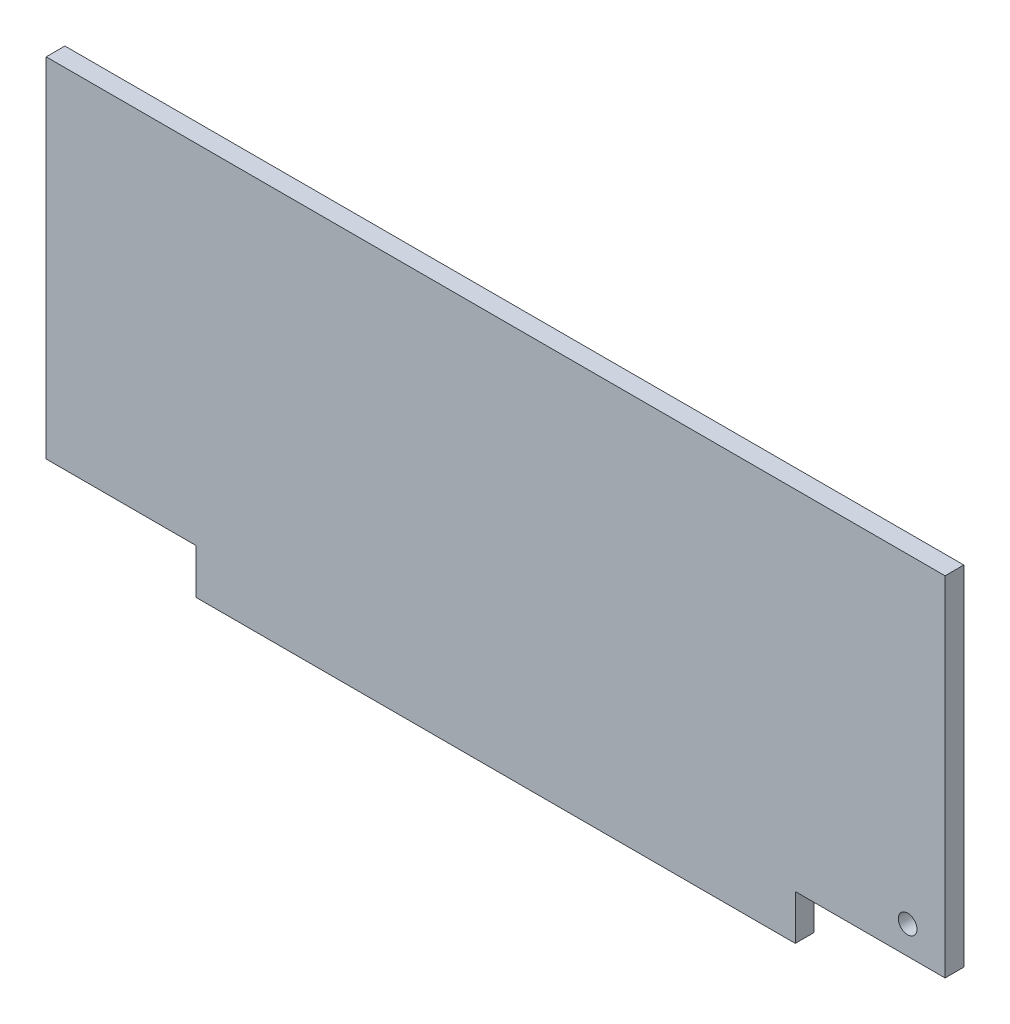
ISO-10303-21;
HEADER;
FILE_DESCRIPTION(('STEP AP214'),'2;1');
FILE_NAME('part.step','',(''),(''),'','','');
FILE_SCHEMA(('AUTOMOTIVE_DESIGN { 1 0 10303 214 1 1 1 1 }'));
ENDSEC;
DATA;
#1=APPLICATION_CONTEXT('core data for automotive mechanical design processes');
#2=APPLICATION_PROTOCOL_DEFINITION('international standard','automotive_design',2000,#1);
#3=PRODUCT_CONTEXT('',#1,'mechanical');
#4=PRODUCT('Part','Part','',(#3));
#5=PRODUCT_RELATED_PRODUCT_CATEGORY('part','',(#4));
#6=PRODUCT_DEFINITION_FORMATION('','',#4);
#7=PRODUCT_DEFINITION_CONTEXT('part definition',#1,'design');
#8=PRODUCT_DEFINITION('design','',#6,#7);
#9=PRODUCT_DEFINITION_SHAPE('','',#8);
#10=(LENGTH_UNIT() NAMED_UNIT(*) SI_UNIT(.MILLI.,.METRE.));
#11=(NAMED_UNIT(*) PLANE_ANGLE_UNIT() SI_UNIT($,.RADIAN.));
#12=(NAMED_UNIT(*) SI_UNIT($,.STERADIAN.) SOLID_ANGLE_UNIT());
#13=UNCERTAINTY_MEASURE_WITH_UNIT(LENGTH_MEASURE(1.E-05),#10,'distance_accuracy_value','');
#14=(GEOMETRIC_REPRESENTATION_CONTEXT(3) GLOBAL_UNCERTAINTY_ASSIGNED_CONTEXT((#13)) GLOBAL_UNIT_ASSIGNED_CONTEXT((#10,
#11,#12)) REPRESENTATION_CONTEXT('',''));
#15=CARTESIAN_POINT('',(0.,0.,0.));
#16=DIRECTION('',(0.,0.,1.));
#17=DIRECTION('',(1.,0.,0.));
#18=AXIS2_PLACEMENT_3D('',#15,#16,#17);
#19=CARTESIAN_POINT('',(-290.,105.,10.));
#20=DIRECTION('',(1.,0.,0.));
#21=DIRECTION('',(0.,0.,-1.));
#22=AXIS2_PLACEMENT_3D('',#19,#20,#21);
#23=PLANE('',#22);
#24=DIRECTION('',(0.,-1.,0.));
#25=VECTOR('',#24,1.);
#26=CARTESIAN_POINT('',(-290.,105.,0.));
#27=LINE('',#26,#25);
#28=CARTESIAN_POINT('',(-290.,105.,0.));
#29=VERTEX_POINT('',#28);
#30=CARTESIAN_POINT('',(-290.,-81.,0.));
#31=VERTEX_POINT('',#30);
#32=EDGE_CURVE('E118',#29,#31,#27,.T.);
#33=ORIENTED_EDGE('',*,*,#32,.T.);
#34=DIRECTION('',(0.,0.,1.));
#35=VECTOR('',#34,1.);
#36=CARTESIAN_POINT('',(-290.,-81.,0.));
#37=LINE('',#36,#35);
#38=CARTESIAN_POINT('',(-290.,-81.,10.));
#39=VERTEX_POINT('',#38);
#40=EDGE_CURVE('E154',#31,#39,#37,.T.);
#41=ORIENTED_EDGE('',*,*,#40,.T.);
#42=DIRECTION('',(0.,-1.,0.));
#43=VECTOR('',#42,1.);
#44=CARTESIAN_POINT('',(-290.,105.,10.));
#45=LINE('',#44,#43);
#46=CARTESIAN_POINT('',(-290.,105.,10.));
#47=VERTEX_POINT('',#46);
#48=EDGE_CURVE('E127',#47,#39,#45,.T.);
#49=ORIENTED_EDGE('',*,*,#48,.F.);
#50=DIRECTION('',(0.,0.,-1.));
#51=VECTOR('',#50,1.);
#52=CARTESIAN_POINT('',(-290.,105.,10.));
#53=LINE('',#52,#51);
#54=EDGE_CURVE('E40',#47,#29,#53,.T.);
#55=ORIENTED_EDGE('',*,*,#54,.T.);
#56=EDGE_LOOP('',(#33,#41,#49,#55));
#57=FACE_BOUND('',#56,.T.);
#58=ADVANCED_FACE('F33',(#57),#23,.F.);
#59=CARTESIAN_POINT('',(-290.,-105.,10.));
#60=DIRECTION('',(0.,1.,0.));
#61=DIRECTION('',(0.,0.,1.));
#62=AXIS2_PLACEMENT_3D('',#59,#60,#61);
#63=PLANE('',#62);
#64=DIRECTION('',(1.,0.,0.));
#65=VECTOR('',#64,1.);
#66=CARTESIAN_POINT('',(-290.,-105.,10.));
#67=LINE('',#66,#65);
#68=CARTESIAN_POINT('',(-210.,-105.,10.));
#69=VERTEX_POINT('',#68);
#70=CARTESIAN_POINT('',(110.,-105.,10.));
#71=VERTEX_POINT('',#70);
#72=EDGE_CURVE('E113',#69,#71,#67,.T.);
#73=ORIENTED_EDGE('',*,*,#72,.F.);
#74=DIRECTION('',(0.,0.,1.));
#75=VECTOR('',#74,1.);
#76=CARTESIAN_POINT('',(-210.,-105.,0.));
#77=LINE('',#76,#75);
#78=CARTESIAN_POINT('',(-210.,-105.,0.));
#79=VERTEX_POINT('',#78);
#80=EDGE_CURVE('E101',#79,#69,#77,.T.);
#81=ORIENTED_EDGE('',*,*,#80,.F.);
#82=DIRECTION('',(1.,0.,0.));
#83=VECTOR('',#82,1.);
#84=CARTESIAN_POINT('',(-290.,-105.,0.));
#85=LINE('',#84,#83);
#86=CARTESIAN_POINT('',(110.,-105.,0.));
#87=VERTEX_POINT('',#86);
#88=EDGE_CURVE('E112',#79,#87,#85,.T.);
#89=ORIENTED_EDGE('',*,*,#88,.T.);
#90=DIRECTION('',(0.,0.,1.));
#91=VECTOR('',#90,1.);
#92=CARTESIAN_POINT('',(110.,-105.,0.));
#93=LINE('',#92,#91);
#94=EDGE_CURVE('E123',#87,#71,#93,.T.);
#95=ORIENTED_EDGE('',*,*,#94,.T.);
#96=EDGE_LOOP('',(#73,#81,#89,#95));
#97=FACE_BOUND('',#96,.T.);
#98=ADVANCED_FACE('F110',(#97),#63,.F.);
#99=CARTESIAN_POINT('',(190.,105.,10.));
#100=DIRECTION('',(-1.,0.,0.));
#101=DIRECTION('',(0.,-1.,0.));
#102=AXIS2_PLACEMENT_3D('',#99,#100,#101);
#103=PLANE('',#102);
#104=DIRECTION('',(0.,1.,0.));
#105=VECTOR('',#104,1.);
#106=CARTESIAN_POINT('',(190.,105.,10.));
#107=LINE('',#106,#105);
#108=CARTESIAN_POINT('',(190.,-81.,10.));
#109=VERTEX_POINT('',#108);
#110=CARTESIAN_POINT('',(190.,105.,10.));
#111=VERTEX_POINT('',#110);
#112=EDGE_CURVE('E134',#109,#111,#107,.T.);
#113=ORIENTED_EDGE('',*,*,#112,.F.);
#114=DIRECTION('',(0.,0.,1.));
#115=VECTOR('',#114,1.);
#116=CARTESIAN_POINT('',(190.,-81.,0.));
#117=LINE('',#116,#115);
#118=CARTESIAN_POINT('',(190.,-81.,0.));
#119=VERTEX_POINT('',#118);
#120=EDGE_CURVE('E142',#119,#109,#117,.T.);
#121=ORIENTED_EDGE('',*,*,#120,.F.);
#122=DIRECTION('',(0.,1.,0.));
#123=VECTOR('',#122,1.);
#124=CARTESIAN_POINT('',(190.,105.,0.));
#125=LINE('',#124,#123);
#126=CARTESIAN_POINT('',(190.,105.,0.));
#127=VERTEX_POINT('',#126);
#128=EDGE_CURVE('E117',#119,#127,#125,.T.);
#129=ORIENTED_EDGE('',*,*,#128,.T.);
#130=DIRECTION('',(0.,0.,-1.));
#131=VECTOR('',#130,1.);
#132=CARTESIAN_POINT('',(190.,105.,10.));
#133=LINE('',#132,#131);
#134=EDGE_CURVE('E11',#111,#127,#133,.T.);
#135=ORIENTED_EDGE('',*,*,#134,.F.);
#136=EDGE_LOOP('',(#113,#121,#129,#135));
#137=FACE_BOUND('',#136,.T.);
#138=ADVANCED_FACE('F190',(#137),#103,.F.);
#139=CARTESIAN_POINT('',(-290.,105.,10.));
#140=DIRECTION('',(0.,-1.,0.));
#141=DIRECTION('',(1.,0.,0.));
#142=AXIS2_PLACEMENT_3D('',#139,#140,#141);
#143=PLANE('',#142);
#144=DIRECTION('',(-1.,0.,0.));
#145=VECTOR('',#144,1.);
#146=CARTESIAN_POINT('',(-290.,105.,0.));
#147=LINE('',#146,#145);
#148=EDGE_CURVE('E120',#127,#29,#147,.T.);
#149=ORIENTED_EDGE('',*,*,#148,.T.);
#150=ORIENTED_EDGE('',*,*,#54,.F.);
#151=DIRECTION('',(-1.,0.,0.));
#152=VECTOR('',#151,1.);
#153=CARTESIAN_POINT('',(-290.,105.,10.));
#154=LINE('',#153,#152);
#155=EDGE_CURVE('E129',#111,#47,#154,.T.);
#156=ORIENTED_EDGE('',*,*,#155,.F.);
#157=ORIENTED_EDGE('',*,*,#134,.T.);
#158=EDGE_LOOP('',(#149,#150,#156,#157));
#159=FACE_BOUND('',#158,.T.);
#160=ADVANCED_FACE('F180',(#159),#143,.F.);
#161=CARTESIAN_POINT('',(0.,0.,10.));
#162=DIRECTION('',(0.,0.,1.));
#163=DIRECTION('',(1.,0.,0.));
#164=AXIS2_PLACEMENT_3D('',#161,#162,#163);
#165=PLANE('',#164);
#166=CARTESIAN_POINT('',(170.,-66.,10.));
#167=DIRECTION('',(0.,0.,1.));
#168=DIRECTION('',(1.,0.,0.));
#169=AXIS2_PLACEMENT_3D('',#166,#167,#168);
#170=CIRCLE('',#169,5.00000000000002);
#171=CARTESIAN_POINT('',(175.,-66.,10.));
#172=VERTEX_POINT('',#171);
#173=EDGE_CURVE('E165',#172,#172,#170,.T.);
#174=ORIENTED_EDGE('',*,*,#173,.F.);
#175=EDGE_LOOP('',(#174));
#176=FACE_BOUND('',#175,.T.);
#177=DIRECTION('',(-1.,0.,0.));
#178=VECTOR('',#177,1.);
#179=CARTESIAN_POINT('',(-290.,-81.,10.));
#180=LINE('',#179,#178);
#181=CARTESIAN_POINT('',(-210.,-81.,10.));
#182=VERTEX_POINT('',#181);
#183=EDGE_CURVE('E106',#182,#39,#180,.T.);
#184=ORIENTED_EDGE('',*,*,#183,.F.);
#185=DIRECTION('',(0.,1.,0.));
#186=VECTOR('',#185,1.);
#187=CARTESIAN_POINT('',(-210.,-105.,10.));
#188=LINE('',#187,#186);
#189=EDGE_CURVE('E161',#69,#182,#188,.T.);
#190=ORIENTED_EDGE('',*,*,#189,.F.);
#191=ORIENTED_EDGE('',*,*,#72,.T.);
#192=DIRECTION('',(0.,-1.,0.));
#193=VECTOR('',#192,1.);
#194=CARTESIAN_POINT('',(110.,-105.,10.));
#195=LINE('',#194,#193);
#196=CARTESIAN_POINT('',(110.,-81.,10.));
#197=VERTEX_POINT('',#196);
#198=EDGE_CURVE('E147',#197,#71,#195,.T.);
#199=ORIENTED_EDGE('',*,*,#198,.F.);
#200=DIRECTION('',(-1.,0.,0.));
#201=VECTOR('',#200,1.);
#202=CARTESIAN_POINT('',(190.,-81.,10.));
#203=LINE('',#202,#201);
#204=EDGE_CURVE('E151',#109,#197,#203,.T.);
#205=ORIENTED_EDGE('',*,*,#204,.F.);
#206=ORIENTED_EDGE('',*,*,#112,.T.);
#207=ORIENTED_EDGE('',*,*,#155,.T.);
#208=ORIENTED_EDGE('',*,*,#48,.T.);
#209=EDGE_LOOP('',(#184,#190,#191,#199,#205,#206,#207,#208));
#210=FACE_BOUND('',#209,.T.);
#211=ADVANCED_FACE('F178',(#176,#210),#165,.T.);
#212=CARTESIAN_POINT('',(0.,0.,0.));
#213=DIRECTION('',(0.,0.,1.));
#214=DIRECTION('',(1.,0.,0.));
#215=AXIS2_PLACEMENT_3D('',#212,#213,#214);
#216=PLANE('',#215);
#217=CARTESIAN_POINT('',(170.,-66.,0.));
#218=DIRECTION('',(0.,0.,1.));
#219=DIRECTION('',(1.,0.,0.));
#220=AXIS2_PLACEMENT_3D('',#217,#218,#219);
#221=CIRCLE('',#220,5.00000000000002);
#222=CARTESIAN_POINT('',(175.,-66.,0.));
#223=VERTEX_POINT('',#222);
#224=EDGE_CURVE('E163',#223,#223,#221,.T.);
#225=ORIENTED_EDGE('',*,*,#224,.T.);
#226=EDGE_LOOP('',(#225));
#227=FACE_BOUND('',#226,.T.);
#228=DIRECTION('',(0.,1.,0.));
#229=VECTOR('',#228,1.);
#230=CARTESIAN_POINT('',(-210.,-105.,0.));
#231=LINE('',#230,#229);
#232=CARTESIAN_POINT('',(-210.,-81.,0.));
#233=VERTEX_POINT('',#232);
#234=EDGE_CURVE('E97',#79,#233,#231,.T.);
#235=ORIENTED_EDGE('',*,*,#234,.T.);
#236=DIRECTION('',(-1.,0.,0.));
#237=VECTOR('',#236,1.);
#238=CARTESIAN_POINT('',(-290.,-81.,0.));
#239=LINE('',#238,#237);
#240=EDGE_CURVE('E47',#233,#31,#239,.T.);
#241=ORIENTED_EDGE('',*,*,#240,.T.);
#242=ORIENTED_EDGE('',*,*,#32,.F.);
#243=ORIENTED_EDGE('',*,*,#148,.F.);
#244=ORIENTED_EDGE('',*,*,#128,.F.);
#245=DIRECTION('',(-1.,0.,0.));
#246=VECTOR('',#245,1.);
#247=CARTESIAN_POINT('',(190.,-81.,0.));
#248=LINE('',#247,#246);
#249=CARTESIAN_POINT('',(110.,-81.,0.));
#250=VERTEX_POINT('',#249);
#251=EDGE_CURVE('E150',#119,#250,#248,.T.);
#252=ORIENTED_EDGE('',*,*,#251,.T.);
#253=DIRECTION('',(0.,-1.,0.));
#254=VECTOR('',#253,1.);
#255=CARTESIAN_POINT('',(110.,-105.,0.));
#256=LINE('',#255,#254);
#257=EDGE_CURVE('E55',#250,#87,#256,.T.);
#258=ORIENTED_EDGE('',*,*,#257,.T.);
#259=ORIENTED_EDGE('',*,*,#88,.F.);
#260=EDGE_LOOP('',(#235,#241,#242,#243,#244,#252,#258,#259));
#261=FACE_BOUND('',#260,.T.);
#262=ADVANCED_FACE('F115',(#227,#261),#216,.F.);
#263=CARTESIAN_POINT('',(110.,-105.,0.));
#264=DIRECTION('',(-1.,0.,0.));
#265=DIRECTION('',(0.,0.,1.));
#266=AXIS2_PLACEMENT_3D('',#263,#264,#265);
#267=PLANE('',#266);
#268=ORIENTED_EDGE('',*,*,#198,.T.);
#269=ORIENTED_EDGE('',*,*,#94,.F.);
#270=ORIENTED_EDGE('',*,*,#257,.F.);
#271=DIRECTION('',(0.,0.,1.));
#272=VECTOR('',#271,1.);
#273=CARTESIAN_POINT('',(110.,-81.,0.));
#274=LINE('',#273,#272);
#275=EDGE_CURVE('E144',#250,#197,#274,.T.);
#276=ORIENTED_EDGE('',*,*,#275,.T.);
#277=EDGE_LOOP('',(#268,#269,#270,#276));
#278=FACE_BOUND('',#277,.T.);
#279=ADVANCED_FACE('F196',(#278),#267,.F.);
#280=CARTESIAN_POINT('',(190.,-81.,0.));
#281=DIRECTION('',(0.,1.,0.));
#282=DIRECTION('',(0.,0.,1.));
#283=AXIS2_PLACEMENT_3D('',#280,#281,#282);
#284=PLANE('',#283);
#285=ORIENTED_EDGE('',*,*,#204,.T.);
#286=ORIENTED_EDGE('',*,*,#275,.F.);
#287=ORIENTED_EDGE('',*,*,#251,.F.);
#288=ORIENTED_EDGE('',*,*,#120,.T.);
#289=EDGE_LOOP('',(#285,#286,#287,#288));
#290=FACE_BOUND('',#289,.T.);
#291=ADVANCED_FACE('F194',(#290),#284,.F.);
#292=CARTESIAN_POINT('',(-290.,-81.,0.));
#293=DIRECTION('',(0.,1.,0.));
#294=DIRECTION('',(0.,0.,1.));
#295=AXIS2_PLACEMENT_3D('',#292,#293,#294);
#296=PLANE('',#295);
#297=ORIENTED_EDGE('',*,*,#183,.T.);
#298=ORIENTED_EDGE('',*,*,#40,.F.);
#299=ORIENTED_EDGE('',*,*,#240,.F.);
#300=DIRECTION('',(0.,0.,1.));
#301=VECTOR('',#300,1.);
#302=CARTESIAN_POINT('',(-210.,-81.,0.));
#303=LINE('',#302,#301);
#304=EDGE_CURVE('E103',#233,#182,#303,.T.);
#305=ORIENTED_EDGE('',*,*,#304,.T.);
#306=EDGE_LOOP('',(#297,#298,#299,#305));
#307=FACE_BOUND('',#306,.T.);
#308=ADVANCED_FACE('F183',(#307),#296,.F.);
#309=CARTESIAN_POINT('',(-210.,-105.,0.));
#310=DIRECTION('',(1.,0.,0.));
#311=DIRECTION('',(0.,0.,-1.));
#312=AXIS2_PLACEMENT_3D('',#309,#310,#311);
#313=PLANE('',#312);
#314=ORIENTED_EDGE('',*,*,#189,.T.);
#315=ORIENTED_EDGE('',*,*,#304,.F.);
#316=ORIENTED_EDGE('',*,*,#234,.F.);
#317=ORIENTED_EDGE('',*,*,#80,.T.);
#318=EDGE_LOOP('',(#314,#315,#316,#317));
#319=FACE_BOUND('',#318,.T.);
#320=ADVANCED_FACE('F100',(#319),#313,.F.);
#321=CARTESIAN_POINT('',(170.,-66.,0.));
#322=DIRECTION('',(0.,0.,1.));
#323=DIRECTION('',(1.,0.,0.));
#324=AXIS2_PLACEMENT_3D('',#321,#322,#323);
#325=CYLINDRICAL_SURFACE('',#324,5.00000000000002);
#326=ORIENTED_EDGE('',*,*,#224,.F.);
#327=EDGE_LOOP('',(#326));
#328=FACE_BOUND('',#327,.T.);
#329=ORIENTED_EDGE('',*,*,#173,.T.);
#330=EDGE_LOOP('',(#329));
#331=FACE_BOUND('',#330,.T.);
#332=ADVANCED_FACE('F172',(#328,#331),#325,.F.);
#333=CLOSED_SHELL('',(#58,#98,#138,#160,#211,#262,#279,#291,#308,#320,#332));
#334=MANIFOLD_SOLID_BREP('B2',#333);
#335=ADVANCED_BREP_SHAPE_REPRESENTATION('',(#18,#334),#14);
#336=SHAPE_DEFINITION_REPRESENTATION(#9,#335);
ENDSEC;
END-ISO-10303-21;
